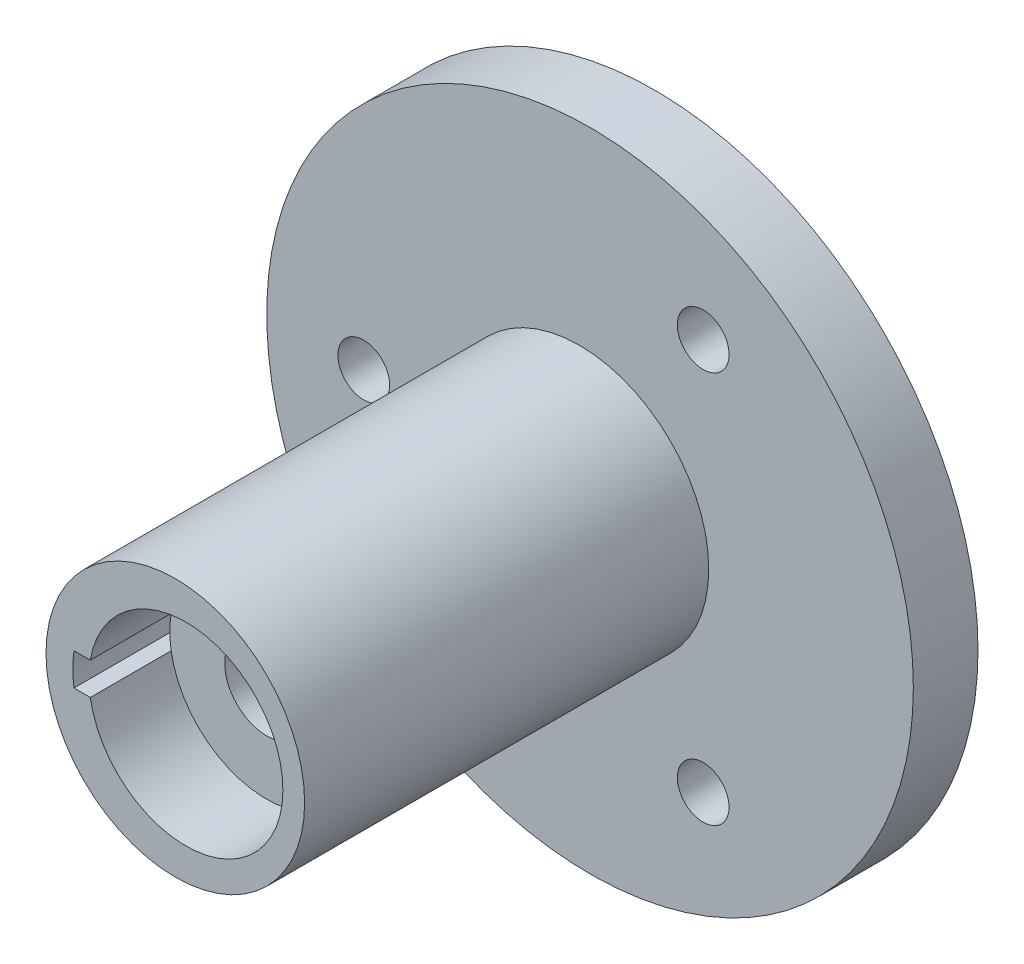
ISO-10303-21;
HEADER;
FILE_DESCRIPTION(('STEP AP214'),'2;1');
FILE_NAME('part.step','',(''),(''),'','','');
FILE_SCHEMA(('AUTOMOTIVE_DESIGN { 1 0 10303 214 1 1 1 1 }'));
ENDSEC;
DATA;
#1=APPLICATION_CONTEXT('core data for automotive mechanical design processes');
#2=APPLICATION_PROTOCOL_DEFINITION('international standard','automotive_design',2000,#1);
#3=PRODUCT_CONTEXT('',#1,'mechanical');
#4=PRODUCT('Part','Part','',(#3));
#5=PRODUCT_RELATED_PRODUCT_CATEGORY('part','',(#4));
#6=PRODUCT_DEFINITION_FORMATION('','',#4);
#7=PRODUCT_DEFINITION_CONTEXT('part definition',#1,'design');
#8=PRODUCT_DEFINITION('design','',#6,#7);
#9=PRODUCT_DEFINITION_SHAPE('','',#8);
#10=(LENGTH_UNIT() NAMED_UNIT(*) SI_UNIT(.MILLI.,.METRE.));
#11=(NAMED_UNIT(*) PLANE_ANGLE_UNIT() SI_UNIT($,.RADIAN.));
#12=(NAMED_UNIT(*) SI_UNIT($,.STERADIAN.) SOLID_ANGLE_UNIT());
#13=UNCERTAINTY_MEASURE_WITH_UNIT(LENGTH_MEASURE(1.E-05),#10,'distance_accuracy_value','');
#14=(GEOMETRIC_REPRESENTATION_CONTEXT(3) GLOBAL_UNCERTAINTY_ASSIGNED_CONTEXT((#13)) GLOBAL_UNIT_ASSIGNED_CONTEXT((#10,
#11,#12)) REPRESENTATION_CONTEXT('',''));
#15=CARTESIAN_POINT('',(0.,0.,0.));
#16=DIRECTION('',(0.,0.,1.));
#17=DIRECTION('',(1.,0.,0.));
#18=AXIS2_PLACEMENT_3D('',#15,#16,#17);
#19=CARTESIAN_POINT('',(0.,0.,0.));
#20=DIRECTION('',(0.,0.,1.));
#21=DIRECTION('',(1.,0.,0.));
#22=AXIS2_PLACEMENT_3D('',#19,#20,#21);
#23=PLANE('',#22);
#24=DIRECTION('',(-1.,0.,0.));
#25=VECTOR('',#24,1.);
#26=CARTESIAN_POINT('',(0.,-2.5,0.));
#27=LINE('',#26,#25);
#28=CARTESIAN_POINT('',(-14.790199457749,-2.5,0.));
#29=VERTEX_POINT('',#28);
#30=CARTESIAN_POINT('',(-17.3205080756888,-2.5,0.));
#31=VERTEX_POINT('',#30);
#32=EDGE_CURVE('E223',#29,#31,#27,.T.);
#33=ORIENTED_EDGE('',*,*,#32,.F.);
#34=CARTESIAN_POINT('',(0.,0.,0.));
#35=DIRECTION('',(0.,0.,1.));
#36=DIRECTION('',(1.,0.,0.));
#37=AXIS2_PLACEMENT_3D('',#34,#35,#36);
#38=CIRCLE('',#37,15.);
#39=CARTESIAN_POINT('',(-14.790199457749,2.5,0.));
#40=VERTEX_POINT('',#39);
#41=EDGE_CURVE('E98',#40,#29,#38,.T.);
#42=ORIENTED_EDGE('',*,*,#41,.F.);
#43=DIRECTION('',(-1.,0.,0.));
#44=VECTOR('',#43,1.);
#45=CARTESIAN_POINT('',(0.,2.5,0.));
#46=LINE('',#45,#44);
#47=CARTESIAN_POINT('',(-17.3205080756888,2.5,0.));
#48=VERTEX_POINT('',#47);
#49=EDGE_CURVE('E110',#40,#48,#46,.T.);
#50=ORIENTED_EDGE('',*,*,#49,.T.);
#51=CARTESIAN_POINT('',(0.,0.,0.));
#52=DIRECTION('',(0.,0.,1.));
#53=DIRECTION('',(1.,0.,0.));
#54=AXIS2_PLACEMENT_3D('',#51,#52,#53);
#55=CIRCLE('',#54,17.5);
#56=EDGE_CURVE('E111',#48,#31,#55,.T.);
#57=ORIENTED_EDGE('',*,*,#56,.T.);
#58=EDGE_LOOP('',(#33,#42,#50,#57));
#59=FACE_BOUND('',#58,.T.);
#60=ADVANCED_FACE('F34',(#59),#23,.T.);
#61=CARTESIAN_POINT('',(0.,0.,0.));
#62=DIRECTION('',(0.,0.,1.));
#63=DIRECTION('',(1.,0.,0.));
#64=AXIS2_PLACEMENT_3D('',#61,#62,#63);
#65=CIRCLE('',#64,50.);
#66=CARTESIAN_POINT('',(50.,0.,0.));
#67=VERTEX_POINT('',#66);
#68=EDGE_CURVE('E44',#67,#67,#65,.T.);
#69=ORIENTED_EDGE('',*,*,#68,.T.);
#70=EDGE_LOOP('',(#69));
#71=FACE_BOUND('',#70,.T.);
#72=CARTESIAN_POINT('',(-35.,0.,0.));
#73=DIRECTION('',(0.,0.,1.));
#74=DIRECTION('',(1.,0.,0.));
#75=AXIS2_PLACEMENT_3D('',#72,#73,#74);
#76=CIRCLE('',#75,4.);
#77=CARTESIAN_POINT('',(-31.,0.,0.));
#78=VERTEX_POINT('',#77);
#79=EDGE_CURVE('E132',#78,#78,#76,.T.);
#80=ORIENTED_EDGE('',*,*,#79,.F.);
#81=EDGE_LOOP('',(#80));
#82=FACE_BOUND('',#81,.T.);
#83=CARTESIAN_POINT('',(17.5000000000001,30.3108891324553,0.));
#84=DIRECTION('',(0.,0.,1.));
#85=DIRECTION('',(1.,0.,0.));
#86=AXIS2_PLACEMENT_3D('',#83,#84,#85);
#87=CIRCLE('',#86,4.);
#88=CARTESIAN_POINT('',(21.5000000000001,30.3108891324553,0.));
#89=VERTEX_POINT('',#88);
#90=EDGE_CURVE('E129',#89,#89,#87,.T.);
#91=ORIENTED_EDGE('',*,*,#90,.F.);
#92=EDGE_LOOP('',(#91));
#93=FACE_BOUND('',#92,.T.);
#94=CARTESIAN_POINT('',(17.4999999999997,-30.3108891324555,0.));
#95=DIRECTION('',(0.,0.,1.));
#96=DIRECTION('',(1.,0.,0.));
#97=AXIS2_PLACEMENT_3D('',#94,#95,#96);
#98=CIRCLE('',#97,4.);
#99=CARTESIAN_POINT('',(21.4999999999997,-30.3108891324555,0.));
#100=VERTEX_POINT('',#99);
#101=EDGE_CURVE('E123',#100,#100,#98,.T.);
#102=ORIENTED_EDGE('',*,*,#101,.F.);
#103=EDGE_LOOP('',(#102));
#104=FACE_BOUND('',#103,.T.);
#105=CARTESIAN_POINT('',(-1.64092182541253,0.,0.));
#106=DIRECTION('',(0.,0.,1.));
#107=DIRECTION('',(1.,0.,0.));
#108=AXIS2_PLACEMENT_3D('',#105,#106,#107);
#109=CIRCLE('',#108,20.);
#110=CARTESIAN_POINT('',(18.3590781745875,0.,0.));
#111=VERTEX_POINT('',#110);
#112=EDGE_CURVE('E213',#111,#111,#109,.T.);
#113=ORIENTED_EDGE('',*,*,#112,.F.);
#114=EDGE_LOOP('',(#113));
#115=FACE_BOUND('',#114,.T.);
#116=ADVANCED_FACE('F142',(#71,#82,#93,#104,#115),#23,.T.);
#117=CARTESIAN_POINT('',(0.,0.,-10.));
#118=DIRECTION('',(0.,0.,1.));
#119=DIRECTION('',(1.,0.,0.));
#120=AXIS2_PLACEMENT_3D('',#117,#118,#119);
#121=CYLINDRICAL_SURFACE('',#120,50.);
#122=CARTESIAN_POINT('',(0.,0.,-10.));
#123=DIRECTION('',(0.,0.,1.));
#124=DIRECTION('',(1.,0.,0.));
#125=AXIS2_PLACEMENT_3D('',#122,#123,#124);
#126=CIRCLE('',#125,50.);
#127=CARTESIAN_POINT('',(50.,0.,-10.));
#128=VERTEX_POINT('',#127);
#129=EDGE_CURVE('E11',#128,#128,#126,.T.);
#130=ORIENTED_EDGE('',*,*,#129,.T.);
#131=EDGE_LOOP('',(#130));
#132=FACE_BOUND('',#131,.T.);
#133=ORIENTED_EDGE('',*,*,#68,.F.);
#134=EDGE_LOOP('',(#133));
#135=FACE_BOUND('',#134,.T.);
#136=ADVANCED_FACE('F36',(#132,#135),#121,.T.);
#137=CARTESIAN_POINT('',(0.,0.,-10.));
#138=DIRECTION('',(0.,0.,1.));
#139=DIRECTION('',(1.,0.,0.));
#140=AXIS2_PLACEMENT_3D('',#137,#138,#139);
#141=PLANE('',#140);
#142=CARTESIAN_POINT('',(0.,0.,-10.));
#143=DIRECTION('',(0.,0.,1.));
#144=DIRECTION('',(1.,0.,0.));
#145=AXIS2_PLACEMENT_3D('',#142,#143,#144);
#146=CIRCLE('',#145,6.5);
#147=CARTESIAN_POINT('',(6.5,0.,-10.));
#148=VERTEX_POINT('',#147);
#149=EDGE_CURVE('E205',#148,#148,#146,.T.);
#150=ORIENTED_EDGE('',*,*,#149,.T.);
#151=EDGE_LOOP('',(#150));
#152=FACE_BOUND('',#151,.T.);
#153=CARTESIAN_POINT('',(17.4999999999997,-30.3108891324555,-10.));
#154=DIRECTION('',(0.,0.,1.));
#155=DIRECTION('',(1.,0.,0.));
#156=AXIS2_PLACEMENT_3D('',#153,#154,#155);
#157=CIRCLE('',#156,4.);
#158=CARTESIAN_POINT('',(21.4999999999997,-30.3108891324555,-10.));
#159=VERTEX_POINT('',#158);
#160=EDGE_CURVE('E118',#159,#159,#157,.T.);
#161=ORIENTED_EDGE('',*,*,#160,.T.);
#162=EDGE_LOOP('',(#161));
#163=FACE_BOUND('',#162,.T.);
#164=CARTESIAN_POINT('',(17.5000000000001,30.3108891324553,-10.));
#165=DIRECTION('',(0.,0.,1.));
#166=DIRECTION('',(1.,0.,0.));
#167=AXIS2_PLACEMENT_3D('',#164,#165,#166);
#168=CIRCLE('',#167,4.);
#169=CARTESIAN_POINT('',(21.5000000000001,30.3108891324553,-10.));
#170=VERTEX_POINT('',#169);
#171=EDGE_CURVE('E126',#170,#170,#168,.T.);
#172=ORIENTED_EDGE('',*,*,#171,.T.);
#173=EDGE_LOOP('',(#172));
#174=FACE_BOUND('',#173,.T.);
#175=CARTESIAN_POINT('',(-35.,0.,-10.));
#176=DIRECTION('',(0.,0.,1.));
#177=DIRECTION('',(1.,0.,0.));
#178=AXIS2_PLACEMENT_3D('',#175,#176,#177);
#179=CIRCLE('',#178,4.);
#180=CARTESIAN_POINT('',(-31.,0.,-10.));
#181=VERTEX_POINT('',#180);
#182=EDGE_CURVE('E135',#181,#181,#179,.T.);
#183=ORIENTED_EDGE('',*,*,#182,.T.);
#184=EDGE_LOOP('',(#183));
#185=FACE_BOUND('',#184,.T.);
#186=ORIENTED_EDGE('',*,*,#129,.F.);
#187=EDGE_LOOP('',(#186));
#188=FACE_BOUND('',#187,.T.);
#189=ADVANCED_FACE('F146',(#152,#163,#174,#185,#188),#141,.F.);
#190=CARTESIAN_POINT('',(-35.,0.,-10.));
#191=DIRECTION('',(0.,0.,1.));
#192=DIRECTION('',(1.,0.,0.));
#193=AXIS2_PLACEMENT_3D('',#190,#191,#192);
#194=CYLINDRICAL_SURFACE('',#193,4.);
#195=ORIENTED_EDGE('',*,*,#182,.F.);
#196=EDGE_LOOP('',(#195));
#197=FACE_BOUND('',#196,.T.);
#198=ORIENTED_EDGE('',*,*,#79,.T.);
#199=EDGE_LOOP('',(#198));
#200=FACE_BOUND('',#199,.T.);
#201=ADVANCED_FACE('F152',(#197,#200),#194,.F.);
#202=CARTESIAN_POINT('',(17.5000000000001,30.3108891324553,-10.));
#203=DIRECTION('',(0.,0.,1.));
#204=DIRECTION('',(1.,0.,0.));
#205=AXIS2_PLACEMENT_3D('',#202,#203,#204);
#206=CYLINDRICAL_SURFACE('',#205,4.);
#207=ORIENTED_EDGE('',*,*,#171,.F.);
#208=EDGE_LOOP('',(#207));
#209=FACE_BOUND('',#208,.T.);
#210=ORIENTED_EDGE('',*,*,#90,.T.);
#211=EDGE_LOOP('',(#210));
#212=FACE_BOUND('',#211,.T.);
#213=ADVANCED_FACE('F163',(#209,#212),#206,.F.);
#214=CARTESIAN_POINT('',(17.4999999999997,-30.3108891324555,-10.));
#215=DIRECTION('',(0.,0.,1.));
#216=DIRECTION('',(1.,0.,0.));
#217=AXIS2_PLACEMENT_3D('',#214,#215,#216);
#218=CYLINDRICAL_SURFACE('',#217,4.);
#219=ORIENTED_EDGE('',*,*,#160,.F.);
#220=EDGE_LOOP('',(#219));
#221=FACE_BOUND('',#220,.T.);
#222=ORIENTED_EDGE('',*,*,#101,.T.);
#223=EDGE_LOOP('',(#222));
#224=FACE_BOUND('',#223,.T.);
#225=ADVANCED_FACE('F167',(#221,#224),#218,.F.);
#226=CARTESIAN_POINT('',(0.,0.,62.5));
#227=DIRECTION('',(0.,0.,-1.));
#228=DIRECTION('',(-1.,0.,0.));
#229=AXIS2_PLACEMENT_3D('',#226,#227,#228);
#230=CYLINDRICAL_SURFACE('',#229,17.5);
#231=ORIENTED_EDGE('',*,*,#56,.F.);
#232=DIRECTION('',(0.,0.,-1.));
#233=VECTOR('',#232,1.);
#234=CARTESIAN_POINT('',(-17.3205080756888,2.5,62.5));
#235=LINE('',#234,#233);
#236=CARTESIAN_POINT('',(-17.3205080756888,2.5,62.5));
#237=VERTEX_POINT('',#236);
#238=EDGE_CURVE('E80',#237,#48,#235,.T.);
#239=ORIENTED_EDGE('',*,*,#238,.F.);
#240=CARTESIAN_POINT('',(0.,0.,62.5));
#241=DIRECTION('',(0.,0.,1.));
#242=DIRECTION('',(1.,0.,0.));
#243=AXIS2_PLACEMENT_3D('',#240,#241,#242);
#244=CIRCLE('',#243,17.5);
#245=CARTESIAN_POINT('',(-17.3205080756888,-2.5,62.5));
#246=VERTEX_POINT('',#245);
#247=EDGE_CURVE('E210',#237,#246,#244,.T.);
#248=ORIENTED_EDGE('',*,*,#247,.T.);
#249=DIRECTION('',(0.,0.,-1.));
#250=VECTOR('',#249,1.);
#251=CARTESIAN_POINT('',(-17.3205080756888,-2.5,62.5));
#252=LINE('',#251,#250);
#253=EDGE_CURVE('E76',#246,#31,#252,.T.);
#254=ORIENTED_EDGE('',*,*,#253,.T.);
#255=EDGE_LOOP('',(#231,#239,#248,#254));
#256=FACE_BOUND('',#255,.T.);
#257=ADVANCED_FACE('F171',(#256),#230,.F.);
#258=CARTESIAN_POINT('',(0.,2.5,62.5));
#259=DIRECTION('',(0.,-1.,0.));
#260=DIRECTION('',(0.,0.,-1.));
#261=AXIS2_PLACEMENT_3D('',#258,#259,#260);
#262=PLANE('',#261);
#263=ORIENTED_EDGE('',*,*,#49,.F.);
#264=DIRECTION('',(0.,0.,-1.));
#265=VECTOR('',#264,1.);
#266=CARTESIAN_POINT('',(-14.790199457749,2.5,50.));
#267=LINE('',#266,#265);
#268=CARTESIAN_POINT('',(-14.790199457749,2.5,50.));
#269=VERTEX_POINT('',#268);
#270=EDGE_CURVE('E69',#40,#269,#267,.F.);
#271=ORIENTED_EDGE('',*,*,#270,.T.);
#272=DIRECTION('',(0.,0.,-1.));
#273=VECTOR('',#272,1.);
#274=CARTESIAN_POINT('',(-14.790199457749,2.5,62.5));
#275=LINE('',#274,#273);
#276=CARTESIAN_POINT('',(-14.790199457749,2.5,62.5));
#277=VERTEX_POINT('',#276);
#278=EDGE_CURVE('E107',#277,#269,#275,.T.);
#279=ORIENTED_EDGE('',*,*,#278,.F.);
#280=DIRECTION('',(-1.,0.,0.));
#281=VECTOR('',#280,1.);
#282=CARTESIAN_POINT('',(0.,2.5,62.5));
#283=LINE('',#282,#281);
#284=EDGE_CURVE('E212',#277,#237,#283,.T.);
#285=ORIENTED_EDGE('',*,*,#284,.T.);
#286=ORIENTED_EDGE('',*,*,#238,.T.);
#287=EDGE_LOOP('',(#263,#271,#279,#285,#286));
#288=FACE_BOUND('',#287,.T.);
#289=ADVANCED_FACE('F105',(#288),#262,.T.);
#290=CARTESIAN_POINT('',(0.,0.,62.5));
#291=DIRECTION('',(0.,0.,-1.));
#292=DIRECTION('',(-1.,0.,0.));
#293=AXIS2_PLACEMENT_3D('',#290,#291,#292);
#294=CYLINDRICAL_SURFACE('',#293,15.);
#295=CARTESIAN_POINT('',(0.,0.,50.));
#296=DIRECTION('',(0.,0.,1.));
#297=DIRECTION('',(1.,0.,0.));
#298=AXIS2_PLACEMENT_3D('',#295,#296,#297);
#299=CIRCLE('',#298,15.);
#300=CARTESIAN_POINT('',(-14.790199457749,-2.5,50.));
#301=VERTEX_POINT('',#300);
#302=EDGE_CURVE('E92',#301,#269,#299,.T.);
#303=ORIENTED_EDGE('',*,*,#302,.F.);
#304=DIRECTION('',(0.,0.,-1.));
#305=VECTOR('',#304,1.);
#306=CARTESIAN_POINT('',(-14.790199457749,-2.5,62.5));
#307=LINE('',#306,#305);
#308=CARTESIAN_POINT('',(-14.790199457749,-2.5,62.5));
#309=VERTEX_POINT('',#308);
#310=EDGE_CURVE('E116',#309,#301,#307,.T.);
#311=ORIENTED_EDGE('',*,*,#310,.F.);
#312=CARTESIAN_POINT('',(0.,0.,62.5));
#313=DIRECTION('',(0.,0.,1.));
#314=DIRECTION('',(1.,0.,0.));
#315=AXIS2_PLACEMENT_3D('',#312,#313,#314);
#316=CIRCLE('',#315,15.);
#317=EDGE_CURVE('E115',#309,#277,#316,.T.);
#318=ORIENTED_EDGE('',*,*,#317,.T.);
#319=ORIENTED_EDGE('',*,*,#278,.T.);
#320=EDGE_LOOP('',(#303,#311,#318,#319));
#321=FACE_BOUND('',#320,.T.);
#322=ADVANCED_FACE('F114',(#321),#294,.F.);
#323=CARTESIAN_POINT('',(0.,-2.5,62.5));
#324=DIRECTION('',(0.,-1.,0.));
#325=DIRECTION('',(0.,0.,-1.));
#326=AXIS2_PLACEMENT_3D('',#323,#324,#325);
#327=PLANE('',#326);
#328=ORIENTED_EDGE('',*,*,#32,.T.);
#329=ORIENTED_EDGE('',*,*,#253,.F.);
#330=DIRECTION('',(-1.,0.,0.));
#331=VECTOR('',#330,1.);
#332=CARTESIAN_POINT('',(0.,-2.5,62.5));
#333=LINE('',#332,#331);
#334=EDGE_CURVE('E53',#309,#246,#333,.T.);
#335=ORIENTED_EDGE('',*,*,#334,.F.);
#336=ORIENTED_EDGE('',*,*,#310,.T.);
#337=DIRECTION('',(0.,0.,-1.));
#338=VECTOR('',#337,1.);
#339=CARTESIAN_POINT('',(-14.790199457749,-2.5,50.));
#340=LINE('',#339,#338);
#341=EDGE_CURVE('E102',#29,#301,#340,.F.);
#342=ORIENTED_EDGE('',*,*,#341,.F.);
#343=EDGE_LOOP('',(#328,#329,#335,#336,#342));
#344=FACE_BOUND('',#343,.T.);
#345=ADVANCED_FACE('F179',(#344),#327,.F.);
#346=CARTESIAN_POINT('',(-1.64092182541253,0.,62.5));
#347=DIRECTION('',(0.,0.,-1.));
#348=DIRECTION('',(-1.,0.,0.));
#349=AXIS2_PLACEMENT_3D('',#346,#347,#348);
#350=CYLINDRICAL_SURFACE('',#349,20.);
#351=CARTESIAN_POINT('',(-1.64092182541253,0.,62.5));
#352=DIRECTION('',(0.,0.,1.));
#353=DIRECTION('',(1.,0.,0.));
#354=AXIS2_PLACEMENT_3D('',#351,#352,#353);
#355=CIRCLE('',#354,20.);
#356=CARTESIAN_POINT('',(18.3590781745875,0.,62.5));
#357=VERTEX_POINT('',#356);
#358=EDGE_CURVE('E217',#357,#357,#355,.T.);
#359=ORIENTED_EDGE('',*,*,#358,.F.);
#360=EDGE_LOOP('',(#359));
#361=FACE_BOUND('',#360,.T.);
#362=ORIENTED_EDGE('',*,*,#112,.T.);
#363=EDGE_LOOP('',(#362));
#364=FACE_BOUND('',#363,.T.);
#365=ADVANCED_FACE('F182',(#361,#364),#350,.T.);
#366=CARTESIAN_POINT('',(0.,0.,62.5));
#367=DIRECTION('',(0.,0.,1.));
#368=DIRECTION('',(1.,0.,0.));
#369=AXIS2_PLACEMENT_3D('',#366,#367,#368);
#370=PLANE('',#369);
#371=ORIENTED_EDGE('',*,*,#247,.F.);
#372=ORIENTED_EDGE('',*,*,#284,.F.);
#373=ORIENTED_EDGE('',*,*,#317,.F.);
#374=ORIENTED_EDGE('',*,*,#334,.T.);
#375=EDGE_LOOP('',(#371,#372,#373,#374));
#376=FACE_BOUND('',#375,.T.);
#377=ORIENTED_EDGE('',*,*,#358,.T.);
#378=EDGE_LOOP('',(#377));
#379=FACE_BOUND('',#378,.T.);
#380=ADVANCED_FACE('F186',(#376,#379),#370,.T.);
#381=CARTESIAN_POINT('',(0.,0.,50.));
#382=DIRECTION('',(0.,0.,-1.));
#383=DIRECTION('',(-1.,0.,0.));
#384=AXIS2_PLACEMENT_3D('',#381,#382,#383);
#385=CYLINDRICAL_SURFACE('',#384,15.);
#386=ORIENTED_EDGE('',*,*,#270,.F.);
#387=ORIENTED_EDGE('',*,*,#41,.T.);
#388=ORIENTED_EDGE('',*,*,#341,.T.);
#389=EDGE_CURVE('E94',#269,#301,#299,.T.);
#390=ORIENTED_EDGE('',*,*,#389,.F.);
#391=EDGE_LOOP('',(#386,#387,#388,#390));
#392=FACE_BOUND('',#391,.T.);
#393=ADVANCED_FACE('F100',(#392),#385,.T.);
#394=CARTESIAN_POINT('',(0.,0.,50.));
#395=DIRECTION('',(0.,0.,1.));
#396=DIRECTION('',(1.,0.,0.));
#397=AXIS2_PLACEMENT_3D('',#394,#395,#396);
#398=PLANE('',#397);
#399=CARTESIAN_POINT('',(0.,0.,50.));
#400=DIRECTION('',(0.,0.,1.));
#401=DIRECTION('',(1.,0.,0.));
#402=AXIS2_PLACEMENT_3D('',#399,#400,#401);
#403=CIRCLE('',#402,6.5);
#404=CARTESIAN_POINT('',(6.5,0.,50.));
#405=VERTEX_POINT('',#404);
#406=EDGE_CURVE('E38',#405,#405,#403,.T.);
#407=ORIENTED_EDGE('',*,*,#406,.F.);
#408=EDGE_LOOP('',(#407));
#409=FACE_BOUND('',#408,.T.);
#410=ORIENTED_EDGE('',*,*,#389,.T.);
#411=ORIENTED_EDGE('',*,*,#302,.T.);
#412=EDGE_LOOP('',(#410,#411));
#413=FACE_BOUND('',#412,.T.);
#414=ADVANCED_FACE('F93',(#409,#413),#398,.T.);
#415=CARTESIAN_POINT('',(0.,0.,-10.));
#416=DIRECTION('',(0.,0.,1.));
#417=DIRECTION('',(1.,0.,0.));
#418=AXIS2_PLACEMENT_3D('',#415,#416,#417);
#419=CYLINDRICAL_SURFACE('',#418,6.5);
#420=ORIENTED_EDGE('',*,*,#406,.T.);
#421=EDGE_LOOP('',(#420));
#422=FACE_BOUND('',#421,.T.);
#423=ORIENTED_EDGE('',*,*,#149,.F.);
#424=EDGE_LOOP('',(#423));
#425=FACE_BOUND('',#424,.T.);
#426=ADVANCED_FACE('F194',(#422,#425),#419,.F.);
#427=CLOSED_SHELL('',(#60,#116,#136,#189,#201,#213,#225,#257,#289,#322,#345,#365,#380,#393,#414,#426));
#428=MANIFOLD_SOLID_BREP('B2',#427);
#429=ADVANCED_BREP_SHAPE_REPRESENTATION('',(#18,#428),#14);
#430=SHAPE_DEFINITION_REPRESENTATION(#9,#429);
ENDSEC;
END-ISO-10303-21;
